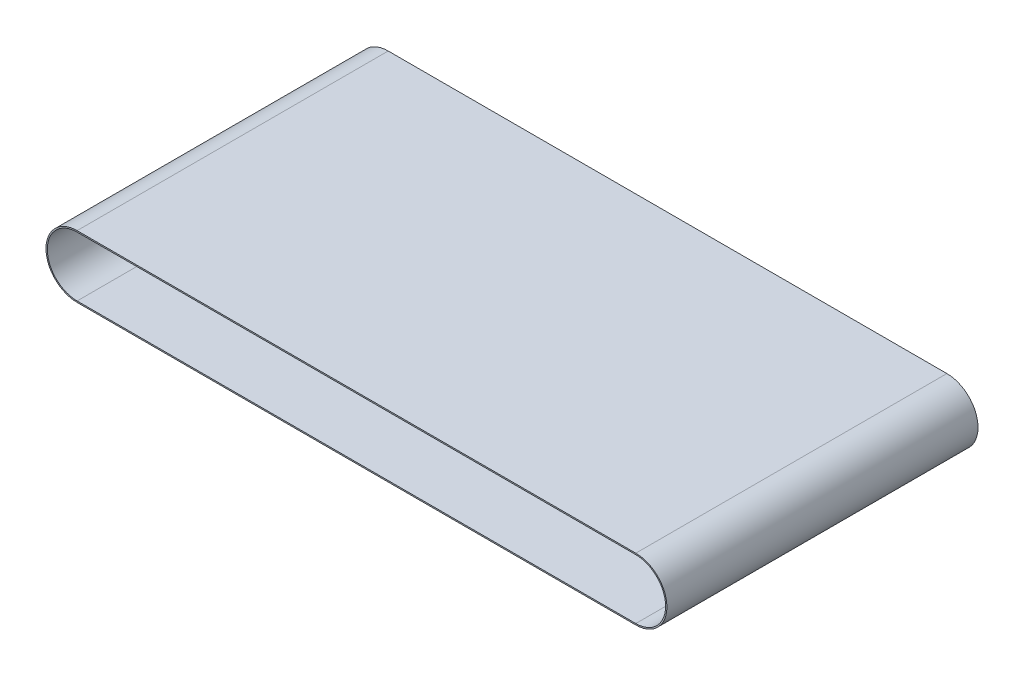
ISO-10303-21;
HEADER;
FILE_DESCRIPTION(('STEP AP214'),'2;1');
FILE_NAME('part.step','',(''),(''),'','','');
FILE_SCHEMA(('AUTOMOTIVE_DESIGN { 1 0 10303 214 1 1 1 1 }'));
ENDSEC;
DATA;
#1=APPLICATION_CONTEXT('core data for automotive mechanical design processes');
#2=APPLICATION_PROTOCOL_DEFINITION('international standard','automotive_design',2000,#1);
#3=PRODUCT_CONTEXT('',#1,'mechanical');
#4=PRODUCT('Part','Part','',(#3));
#5=PRODUCT_RELATED_PRODUCT_CATEGORY('part','',(#4));
#6=PRODUCT_DEFINITION_FORMATION('','',#4);
#7=PRODUCT_DEFINITION_CONTEXT('part definition',#1,'design');
#8=PRODUCT_DEFINITION('design','',#6,#7);
#9=PRODUCT_DEFINITION_SHAPE('','',#8);
#10=(LENGTH_UNIT() NAMED_UNIT(*) SI_UNIT(.MILLI.,.METRE.));
#11=(NAMED_UNIT(*) PLANE_ANGLE_UNIT() SI_UNIT($,.RADIAN.));
#12=(NAMED_UNIT(*) SI_UNIT($,.STERADIAN.) SOLID_ANGLE_UNIT());
#13=UNCERTAINTY_MEASURE_WITH_UNIT(LENGTH_MEASURE(1.E-05),#10,'distance_accuracy_value','');
#14=(GEOMETRIC_REPRESENTATION_CONTEXT(3) GLOBAL_UNCERTAINTY_ASSIGNED_CONTEXT((#13)) GLOBAL_UNIT_ASSIGNED_CONTEXT((#10,
#11,#12)) REPRESENTATION_CONTEXT('',''));
#15=CARTESIAN_POINT('',(0.,0.,0.));
#16=DIRECTION('',(0.,0.,1.));
#17=DIRECTION('',(1.,0.,0.));
#18=AXIS2_PLACEMENT_3D('',#15,#16,#17);
#19=CARTESIAN_POINT('',(-2.75,0.,-60.));
#20=DIRECTION('',(0.,0.,1.));
#21=DIRECTION('',(1.,0.,0.));
#22=AXIS2_PLACEMENT_3D('',#19,#20,#21);
#23=CYLINDRICAL_SURFACE('',#22,12.);
#24=CARTESIAN_POINT('',(-2.75,0.,60.));
#25=DIRECTION('',(0.,0.,1.));
#26=DIRECTION('',(1.,0.,0.));
#27=AXIS2_PLACEMENT_3D('',#24,#25,#26);
#28=CIRCLE('',#27,12.);
#29=CARTESIAN_POINT('',(-2.75,12.,60.));
#30=VERTEX_POINT('',#29);
#31=CARTESIAN_POINT('',(-2.75,-12.,60.));
#32=VERTEX_POINT('',#31);
#33=EDGE_CURVE('E131',#30,#32,#28,.T.);
#34=ORIENTED_EDGE('',*,*,#33,.F.);
#35=DIRECTION('',(0.,0.,1.));
#36=VECTOR('',#35,1.);
#37=CARTESIAN_POINT('',(-2.75,12.,-60.));
#38=LINE('',#37,#36);
#39=CARTESIAN_POINT('',(-2.75,12.,-60.));
#40=VERTEX_POINT('',#39);
#41=EDGE_CURVE('E11',#40,#30,#38,.T.);
#42=ORIENTED_EDGE('',*,*,#41,.F.);
#43=CARTESIAN_POINT('',(-2.75,0.,-60.));
#44=DIRECTION('',(0.,0.,1.));
#45=DIRECTION('',(1.,0.,0.));
#46=AXIS2_PLACEMENT_3D('',#43,#44,#45);
#47=CIRCLE('',#46,12.);
#48=CARTESIAN_POINT('',(-2.75,-12.,-60.));
#49=VERTEX_POINT('',#48);
#50=EDGE_CURVE('E135',#40,#49,#47,.T.);
#51=ORIENTED_EDGE('',*,*,#50,.T.);
#52=DIRECTION('',(0.,0.,1.));
#53=VECTOR('',#52,1.);
#54=CARTESIAN_POINT('',(-2.75,-12.,-60.));
#55=LINE('',#54,#53);
#56=EDGE_CURVE('E36',#49,#32,#55,.T.);
#57=ORIENTED_EDGE('',*,*,#56,.T.);
#58=EDGE_LOOP('',(#34,#42,#51,#57));
#59=FACE_BOUND('',#58,.T.);
#60=ADVANCED_FACE('F33',(#59),#23,.T.);
#61=CARTESIAN_POINT('',(-2.75,12.,-60.));
#62=DIRECTION('',(0.,1.,0.));
#63=DIRECTION('',(0.,0.,1.));
#64=AXIS2_PLACEMENT_3D('',#61,#62,#63);
#65=PLANE('',#64);
#66=DIRECTION('',(-1.,0.,0.));
#67=VECTOR('',#66,1.);
#68=CARTESIAN_POINT('',(-2.75,12.,60.));
#69=LINE('',#68,#67);
#70=CARTESIAN_POINT('',(212.75,12.,60.));
#71=VERTEX_POINT('',#70);
#72=EDGE_CURVE('E139',#71,#30,#69,.T.);
#73=ORIENTED_EDGE('',*,*,#72,.F.);
#74=DIRECTION('',(0.,0.,1.));
#75=VECTOR('',#74,1.);
#76=CARTESIAN_POINT('',(212.75,12.,-60.));
#77=LINE('',#76,#75);
#78=CARTESIAN_POINT('',(212.75,12.,-60.));
#79=VERTEX_POINT('',#78);
#80=EDGE_CURVE('E41',#79,#71,#77,.T.);
#81=ORIENTED_EDGE('',*,*,#80,.F.);
#82=DIRECTION('',(-1.,0.,0.));
#83=VECTOR('',#82,1.);
#84=CARTESIAN_POINT('',(-2.75,12.,-60.));
#85=LINE('',#84,#83);
#86=EDGE_CURVE('E145',#79,#40,#85,.T.);
#87=ORIENTED_EDGE('',*,*,#86,.T.);
#88=ORIENTED_EDGE('',*,*,#41,.T.);
#89=EDGE_LOOP('',(#73,#81,#87,#88));
#90=FACE_BOUND('',#89,.T.);
#91=ADVANCED_FACE('F171',(#90),#65,.T.);
#92=CARTESIAN_POINT('',(212.75,0.,-60.));
#93=DIRECTION('',(0.,0.,1.));
#94=DIRECTION('',(1.,0.,0.));
#95=AXIS2_PLACEMENT_3D('',#92,#93,#94);
#96=CYLINDRICAL_SURFACE('',#95,12.);
#97=CARTESIAN_POINT('',(212.75,0.,60.));
#98=DIRECTION('',(0.,0.,1.));
#99=DIRECTION('',(1.,0.,0.));
#100=AXIS2_PLACEMENT_3D('',#97,#98,#99);
#101=CIRCLE('',#100,12.);
#102=CARTESIAN_POINT('',(212.75,-12.,60.));
#103=VERTEX_POINT('',#102);
#104=EDGE_CURVE('E153',#103,#71,#101,.T.);
#105=ORIENTED_EDGE('',*,*,#104,.F.);
#106=DIRECTION('',(0.,0.,1.));
#107=VECTOR('',#106,1.);
#108=CARTESIAN_POINT('',(212.75,-12.,-60.));
#109=LINE('',#108,#107);
#110=CARTESIAN_POINT('',(212.75,-12.,-60.));
#111=VERTEX_POINT('',#110);
#112=EDGE_CURVE('E158',#111,#103,#109,.T.);
#113=ORIENTED_EDGE('',*,*,#112,.F.);
#114=CARTESIAN_POINT('',(212.75,0.,-60.));
#115=DIRECTION('',(0.,0.,1.));
#116=DIRECTION('',(1.,0.,0.));
#117=AXIS2_PLACEMENT_3D('',#114,#115,#116);
#118=CIRCLE('',#117,12.);
#119=EDGE_CURVE('E142',#111,#79,#118,.T.);
#120=ORIENTED_EDGE('',*,*,#119,.T.);
#121=ORIENTED_EDGE('',*,*,#80,.T.);
#122=EDGE_LOOP('',(#105,#113,#120,#121));
#123=FACE_BOUND('',#122,.T.);
#124=ADVANCED_FACE('F175',(#123),#96,.T.);
#125=CARTESIAN_POINT('',(-2.75,-12.,-60.));
#126=DIRECTION('',(0.,-1.,0.));
#127=DIRECTION('',(0.,0.,-1.));
#128=AXIS2_PLACEMENT_3D('',#125,#126,#127);
#129=PLANE('',#128);
#130=DIRECTION('',(1.,0.,0.));
#131=VECTOR('',#130,1.);
#132=CARTESIAN_POINT('',(-2.75,-12.,60.));
#133=LINE('',#132,#131);
#134=EDGE_CURVE('E150',#32,#103,#133,.T.);
#135=ORIENTED_EDGE('',*,*,#134,.F.);
#136=ORIENTED_EDGE('',*,*,#56,.F.);
#137=DIRECTION('',(1.,0.,0.));
#138=VECTOR('',#137,1.);
#139=CARTESIAN_POINT('',(-2.75,-12.,-60.));
#140=LINE('',#139,#138);
#141=EDGE_CURVE('E138',#49,#111,#140,.T.);
#142=ORIENTED_EDGE('',*,*,#141,.T.);
#143=ORIENTED_EDGE('',*,*,#112,.T.);
#144=EDGE_LOOP('',(#135,#136,#142,#143));
#145=FACE_BOUND('',#144,.T.);
#146=ADVANCED_FACE('F166',(#145),#129,.T.);
#147=CARTESIAN_POINT('',(-2.75,0.,-60.));
#148=DIRECTION('',(0.,0.,1.));
#149=DIRECTION('',(1.,0.,0.));
#150=AXIS2_PLACEMENT_3D('',#147,#148,#149);
#151=PLANE('',#150);
#152=DIRECTION('',(-1.,0.,0.));
#153=VECTOR('',#152,1.);
#154=CARTESIAN_POINT('',(-2.75,11.5,-60.));
#155=LINE('',#154,#153);
#156=CARTESIAN_POINT('',(212.75,11.5,-60.));
#157=VERTEX_POINT('',#156);
#158=CARTESIAN_POINT('',(-2.75,11.5,-60.));
#159=VERTEX_POINT('',#158);
#160=EDGE_CURVE('E106',#157,#159,#155,.T.);
#161=ORIENTED_EDGE('',*,*,#160,.T.);
#162=CARTESIAN_POINT('',(-2.75,0.,-60.));
#163=DIRECTION('',(0.,0.,1.));
#164=DIRECTION('',(1.,0.,0.));
#165=AXIS2_PLACEMENT_3D('',#162,#163,#164);
#166=CIRCLE('',#165,11.5);
#167=CARTESIAN_POINT('',(-2.75,-11.5,-60.));
#168=VERTEX_POINT('',#167);
#169=EDGE_CURVE('E100',#159,#168,#166,.T.);
#170=ORIENTED_EDGE('',*,*,#169,.T.);
#171=DIRECTION('',(1.,0.,0.));
#172=VECTOR('',#171,1.);
#173=CARTESIAN_POINT('',(-2.75,-11.5,-60.));
#174=LINE('',#173,#172);
#175=CARTESIAN_POINT('',(212.75,-11.5,-60.));
#176=VERTEX_POINT('',#175);
#177=EDGE_CURVE('E109',#168,#176,#174,.T.);
#178=ORIENTED_EDGE('',*,*,#177,.T.);
#179=CARTESIAN_POINT('',(212.75,0.,-60.));
#180=DIRECTION('',(0.,0.,1.));
#181=DIRECTION('',(1.,0.,0.));
#182=AXIS2_PLACEMENT_3D('',#179,#180,#181);
#183=CIRCLE('',#182,11.5);
#184=EDGE_CURVE('E49',#176,#157,#183,.T.);
#185=ORIENTED_EDGE('',*,*,#184,.T.);
#186=EDGE_LOOP('',(#161,#170,#178,#185));
#187=FACE_BOUND('',#186,.T.);
#188=ORIENTED_EDGE('',*,*,#50,.F.);
#189=ORIENTED_EDGE('',*,*,#86,.F.);
#190=ORIENTED_EDGE('',*,*,#119,.F.);
#191=ORIENTED_EDGE('',*,*,#141,.F.);
#192=EDGE_LOOP('',(#188,#189,#190,#191));
#193=FACE_BOUND('',#192,.T.);
#194=ADVANCED_FACE('F113',(#187,#193),#151,.F.);
#195=CARTESIAN_POINT('',(-2.75,0.,60.));
#196=DIRECTION('',(0.,0.,1.));
#197=DIRECTION('',(1.,0.,0.));
#198=AXIS2_PLACEMENT_3D('',#195,#196,#197);
#199=PLANE('',#198);
#200=CARTESIAN_POINT('',(-2.75,0.,60.));
#201=DIRECTION('',(0.,0.,1.));
#202=DIRECTION('',(1.,0.,0.));
#203=AXIS2_PLACEMENT_3D('',#200,#201,#202);
#204=CIRCLE('',#203,11.5);
#205=CARTESIAN_POINT('',(-2.75,11.5,60.));
#206=VERTEX_POINT('',#205);
#207=CARTESIAN_POINT('',(-2.75,-11.5,60.));
#208=VERTEX_POINT('',#207);
#209=EDGE_CURVE('E57',#206,#208,#204,.T.);
#210=ORIENTED_EDGE('',*,*,#209,.F.);
#211=DIRECTION('',(-1.,0.,0.));
#212=VECTOR('',#211,1.);
#213=CARTESIAN_POINT('',(-2.75,11.5,60.));
#214=LINE('',#213,#212);
#215=CARTESIAN_POINT('',(212.75,11.5,60.));
#216=VERTEX_POINT('',#215);
#217=EDGE_CURVE('E116',#216,#206,#214,.T.);
#218=ORIENTED_EDGE('',*,*,#217,.F.);
#219=CARTESIAN_POINT('',(212.75,0.,60.));
#220=DIRECTION('',(0.,0.,1.));
#221=DIRECTION('',(1.,0.,0.));
#222=AXIS2_PLACEMENT_3D('',#219,#220,#221);
#223=CIRCLE('',#222,11.5);
#224=CARTESIAN_POINT('',(212.75,-11.5,60.));
#225=VERTEX_POINT('',#224);
#226=EDGE_CURVE('E119',#225,#216,#223,.T.);
#227=ORIENTED_EDGE('',*,*,#226,.F.);
#228=DIRECTION('',(1.,0.,0.));
#229=VECTOR('',#228,1.);
#230=CARTESIAN_POINT('',(-2.75,-11.5,60.));
#231=LINE('',#230,#229);
#232=EDGE_CURVE('E125',#208,#225,#231,.T.);
#233=ORIENTED_EDGE('',*,*,#232,.F.);
#234=EDGE_LOOP('',(#210,#218,#227,#233));
#235=FACE_BOUND('',#234,.T.);
#236=ORIENTED_EDGE('',*,*,#33,.T.);
#237=ORIENTED_EDGE('',*,*,#134,.T.);
#238=ORIENTED_EDGE('',*,*,#104,.T.);
#239=ORIENTED_EDGE('',*,*,#72,.T.);
#240=EDGE_LOOP('',(#236,#237,#238,#239));
#241=FACE_BOUND('',#240,.T.);
#242=ADVANCED_FACE('F168',(#235,#241),#199,.T.);
#243=CARTESIAN_POINT('',(-2.75,0.,-60.));
#244=DIRECTION('',(0.,0.,1.));
#245=DIRECTION('',(1.,0.,0.));
#246=AXIS2_PLACEMENT_3D('',#243,#244,#245);
#247=CYLINDRICAL_SURFACE('',#246,11.5);
#248=ORIENTED_EDGE('',*,*,#209,.T.);
#249=DIRECTION('',(0.,0.,1.));
#250=VECTOR('',#249,1.);
#251=CARTESIAN_POINT('',(-2.75,-11.5,-60.));
#252=LINE('',#251,#250);
#253=EDGE_CURVE('E96',#168,#208,#252,.T.);
#254=ORIENTED_EDGE('',*,*,#253,.F.);
#255=ORIENTED_EDGE('',*,*,#169,.F.);
#256=DIRECTION('',(0.,0.,1.));
#257=VECTOR('',#256,1.);
#258=CARTESIAN_POINT('',(-2.75,11.5,-60.));
#259=LINE('',#258,#257);
#260=EDGE_CURVE('E129',#159,#206,#259,.T.);
#261=ORIENTED_EDGE('',*,*,#260,.T.);
#262=EDGE_LOOP('',(#248,#254,#255,#261));
#263=FACE_BOUND('',#262,.T.);
#264=ADVANCED_FACE('F98',(#263),#247,.F.);
#265=CARTESIAN_POINT('',(-2.75,11.5,-60.));
#266=DIRECTION('',(0.,1.,0.));
#267=DIRECTION('',(0.,0.,1.));
#268=AXIS2_PLACEMENT_3D('',#265,#266,#267);
#269=PLANE('',#268);
#270=ORIENTED_EDGE('',*,*,#217,.T.);
#271=ORIENTED_EDGE('',*,*,#260,.F.);
#272=ORIENTED_EDGE('',*,*,#160,.F.);
#273=DIRECTION('',(0.,0.,1.));
#274=VECTOR('',#273,1.);
#275=CARTESIAN_POINT('',(212.75,11.5,-60.));
#276=LINE('',#275,#274);
#277=EDGE_CURVE('E132',#157,#216,#276,.T.);
#278=ORIENTED_EDGE('',*,*,#277,.T.);
#279=EDGE_LOOP('',(#270,#271,#272,#278));
#280=FACE_BOUND('',#279,.T.);
#281=ADVANCED_FACE('F226',(#280),#269,.F.);
#282=CARTESIAN_POINT('',(212.75,0.,-60.));
#283=DIRECTION('',(0.,0.,1.));
#284=DIRECTION('',(1.,0.,0.));
#285=AXIS2_PLACEMENT_3D('',#282,#283,#284);
#286=CYLINDRICAL_SURFACE('',#285,11.5);
#287=ORIENTED_EDGE('',*,*,#226,.T.);
#288=ORIENTED_EDGE('',*,*,#277,.F.);
#289=ORIENTED_EDGE('',*,*,#184,.F.);
#290=DIRECTION('',(0.,0.,1.));
#291=VECTOR('',#290,1.);
#292=CARTESIAN_POINT('',(212.75,-11.5,-60.));
#293=LINE('',#292,#291);
#294=EDGE_CURVE('E105',#176,#225,#293,.T.);
#295=ORIENTED_EDGE('',*,*,#294,.T.);
#296=EDGE_LOOP('',(#287,#288,#289,#295));
#297=FACE_BOUND('',#296,.T.);
#298=ADVANCED_FACE('F235',(#297),#286,.F.);
#299=CARTESIAN_POINT('',(-2.75,-11.5,-60.));
#300=DIRECTION('',(0.,-1.,0.));
#301=DIRECTION('',(0.,0.,-1.));
#302=AXIS2_PLACEMENT_3D('',#299,#300,#301);
#303=PLANE('',#302);
#304=ORIENTED_EDGE('',*,*,#232,.T.);
#305=ORIENTED_EDGE('',*,*,#294,.F.);
#306=ORIENTED_EDGE('',*,*,#177,.F.);
#307=ORIENTED_EDGE('',*,*,#253,.T.);
#308=EDGE_LOOP('',(#304,#305,#306,#307));
#309=FACE_BOUND('',#308,.T.);
#310=ADVANCED_FACE('F110',(#309),#303,.F.);
#311=CLOSED_SHELL('',(#60,#91,#124,#146,#194,#242,#264,#281,#298,#310));
#312=MANIFOLD_SOLID_BREP('B2',#311);
#313=ADVANCED_BREP_SHAPE_REPRESENTATION('',(#18,#312),#14);
#314=SHAPE_DEFINITION_REPRESENTATION(#9,#313);
ENDSEC;
END-ISO-10303-21;
